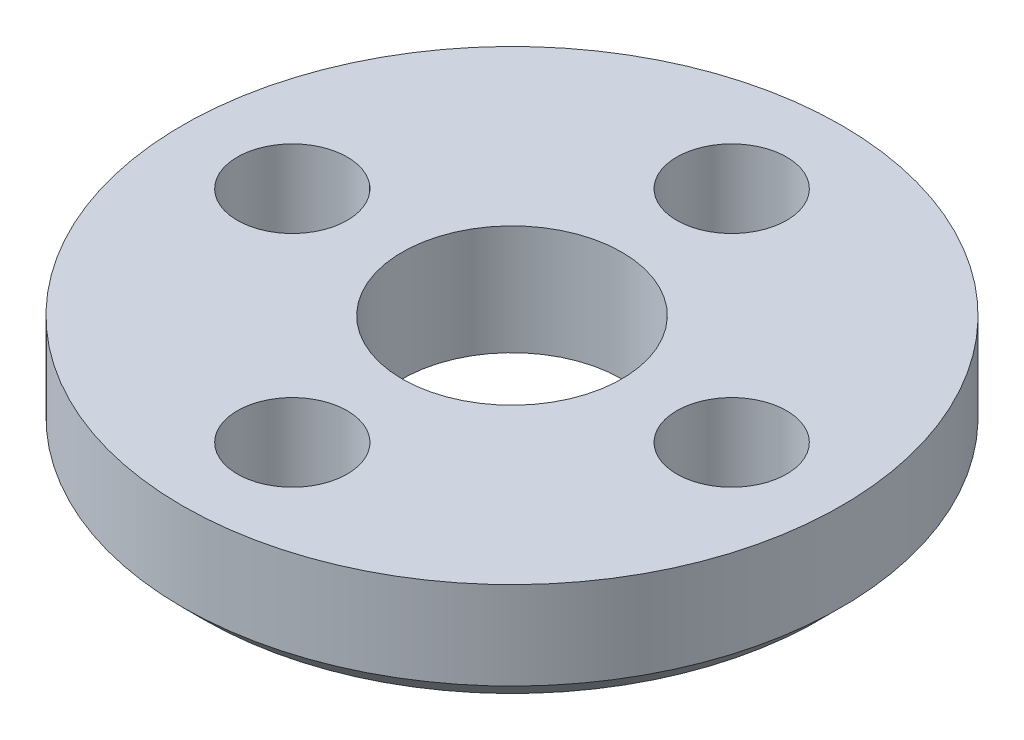
ISO-10303-21;
HEADER;
FILE_DESCRIPTION(('STEP AP214'),'2;1');
FILE_NAME('part.step','',(''),(''),'','','');
FILE_SCHEMA(('AUTOMOTIVE_DESIGN { 1 0 10303 214 1 1 1 1 }'));
ENDSEC;
DATA;
#1=APPLICATION_CONTEXT('core data for automotive mechanical design processes');
#2=APPLICATION_PROTOCOL_DEFINITION('international standard','automotive_design',2000,#1);
#3=PRODUCT_CONTEXT('',#1,'mechanical');
#4=PRODUCT('Part','Part','',(#3));
#5=PRODUCT_RELATED_PRODUCT_CATEGORY('part','',(#4));
#6=PRODUCT_DEFINITION_FORMATION('','',#4);
#7=PRODUCT_DEFINITION_CONTEXT('part definition',#1,'design');
#8=PRODUCT_DEFINITION('design','',#6,#7);
#9=PRODUCT_DEFINITION_SHAPE('','',#8);
#10=(LENGTH_UNIT() NAMED_UNIT(*) SI_UNIT(.MILLI.,.METRE.));
#11=(NAMED_UNIT(*) PLANE_ANGLE_UNIT() SI_UNIT($,.RADIAN.));
#12=(NAMED_UNIT(*) SI_UNIT($,.STERADIAN.) SOLID_ANGLE_UNIT());
#13=UNCERTAINTY_MEASURE_WITH_UNIT(LENGTH_MEASURE(1.E-05),#10,'distance_accuracy_value','');
#14=(GEOMETRIC_REPRESENTATION_CONTEXT(3) GLOBAL_UNCERTAINTY_ASSIGNED_CONTEXT((#13)) GLOBAL_UNIT_ASSIGNED_CONTEXT((#10,
#11,#12)) REPRESENTATION_CONTEXT('',''));
#15=CARTESIAN_POINT('',(0.,0.,0.));
#16=DIRECTION('',(0.,0.,1.));
#17=DIRECTION('',(1.,0.,0.));
#18=AXIS2_PLACEMENT_3D('',#15,#16,#17);
#19=CARTESIAN_POINT('',(0.,-5.,0.));
#20=DIRECTION('',(0.,1.,0.));
#21=DIRECTION('',(0.,0.,1.));
#22=AXIS2_PLACEMENT_3D('',#19,#20,#21);
#23=CYLINDRICAL_SURFACE('',#22,5.);
#24=CARTESIAN_POINT('',(0.,-5.,0.));
#25=DIRECTION('',(0.,1.,0.));
#26=DIRECTION('',(0.,0.,1.));
#27=AXIS2_PLACEMENT_3D('',#24,#25,#26);
#28=CIRCLE('',#27,5.);
#29=CARTESIAN_POINT('',(0.,-5.,5.));
#30=VERTEX_POINT('',#29);
#31=EDGE_CURVE('E61',#30,#30,#28,.T.);
#32=ORIENTED_EDGE('',*,*,#31,.F.);
#33=EDGE_LOOP('',(#32));
#34=FACE_BOUND('',#33,.T.);
#35=CARTESIAN_POINT('',(0.,0.,0.));
#36=DIRECTION('',(0.,1.,0.));
#37=DIRECTION('',(0.,0.,1.));
#38=AXIS2_PLACEMENT_3D('',#35,#36,#37);
#39=CIRCLE('',#38,5.);
#40=CARTESIAN_POINT('',(0.,0.,5.));
#41=VERTEX_POINT('',#40);
#42=EDGE_CURVE('E70',#41,#41,#39,.T.);
#43=ORIENTED_EDGE('',*,*,#42,.T.);
#44=EDGE_LOOP('',(#43));
#45=FACE_BOUND('',#44,.T.);
#46=ADVANCED_FACE('F49',(#34,#45),#23,.F.);
#47=CARTESIAN_POINT('',(0.,-5.,0.));
#48=DIRECTION('',(0.,1.,0.));
#49=DIRECTION('',(0.,0.,1.));
#50=AXIS2_PLACEMENT_3D('',#47,#48,#49);
#51=CYLINDRICAL_SURFACE('',#50,15.);
#52=CARTESIAN_POINT('',(0.,-3.99999999999999,0.));
#53=DIRECTION('',(0.,1.,0.));
#54=DIRECTION('',(0.,0.,1.));
#55=AXIS2_PLACEMENT_3D('',#52,#53,#54);
#56=CIRCLE('',#55,15.);
#57=CARTESIAN_POINT('',(0.,-3.99999999999999,15.));
#58=VERTEX_POINT('',#57);
#59=EDGE_CURVE('E57',#58,#58,#56,.T.);
#60=ORIENTED_EDGE('',*,*,#59,.T.);
#61=EDGE_LOOP('',(#60));
#62=FACE_BOUND('',#61,.T.);
#63=CARTESIAN_POINT('',(0.,0.,0.));
#64=DIRECTION('',(0.,1.,0.));
#65=DIRECTION('',(0.,0.,1.));
#66=AXIS2_PLACEMENT_3D('',#63,#64,#65);
#67=CIRCLE('',#66,15.);
#68=CARTESIAN_POINT('',(0.,0.,15.));
#69=VERTEX_POINT('',#68);
#70=EDGE_CURVE('E65',#69,#69,#67,.T.);
#71=ORIENTED_EDGE('',*,*,#70,.F.);
#72=EDGE_LOOP('',(#71));
#73=FACE_BOUND('',#72,.T.);
#74=ADVANCED_FACE('F123',(#62,#73),#51,.T.);
#75=CARTESIAN_POINT('',(0.,-5.,0.));
#76=DIRECTION('',(0.,1.,0.));
#77=DIRECTION('',(0.,0.,1.));
#78=AXIS2_PLACEMENT_3D('',#75,#76,#77);
#79=PLANE('',#78);
#80=CARTESIAN_POINT('',(0.,-5.,0.));
#81=DIRECTION('',(0.,1.,0.));
#82=DIRECTION('',(0.,0.,1.));
#83=AXIS2_PLACEMENT_3D('',#80,#81,#82);
#84=CIRCLE('',#83,14.);
#85=CARTESIAN_POINT('',(0.,-5.,14.));
#86=VERTEX_POINT('',#85);
#87=EDGE_CURVE('E11',#86,#86,#84,.F.);
#88=ORIENTED_EDGE('',*,*,#87,.T.);
#89=EDGE_LOOP('',(#88));
#90=FACE_BOUND('',#89,.T.);
#91=CARTESIAN_POINT('',(-10.,-5.,0.));
#92=DIRECTION('',(0.,1.,0.));
#93=DIRECTION('',(1.,0.,0.));
#94=AXIS2_PLACEMENT_3D('',#91,#92,#93);
#95=CIRCLE('',#94,2.5);
#96=CARTESIAN_POINT('',(-7.5,-5.,0.));
#97=VERTEX_POINT('',#96);
#98=EDGE_CURVE('E77',#97,#97,#95,.T.);
#99=ORIENTED_EDGE('',*,*,#98,.T.);
#100=EDGE_LOOP('',(#99));
#101=FACE_BOUND('',#100,.T.);
#102=CARTESIAN_POINT('',(0.,-5.,10.));
#103=DIRECTION('',(0.,1.,0.));
#104=DIRECTION('',(0.,0.,-1.));
#105=AXIS2_PLACEMENT_3D('',#102,#103,#104);
#106=CIRCLE('',#105,2.5);
#107=CARTESIAN_POINT('',(0.,-5.,7.5));
#108=VERTEX_POINT('',#107);
#109=EDGE_CURVE('E89',#108,#108,#106,.T.);
#110=ORIENTED_EDGE('',*,*,#109,.T.);
#111=EDGE_LOOP('',(#110));
#112=FACE_BOUND('',#111,.T.);
#113=CARTESIAN_POINT('',(10.,-5.,-1.0413211676572E-13));
#114=DIRECTION('',(0.,1.,0.));
#115=DIRECTION('',(-1.,0.,0.));
#116=AXIS2_PLACEMENT_3D('',#113,#114,#115);
#117=CIRCLE('',#116,2.5);
#118=CARTESIAN_POINT('',(7.5,-5.,0.));
#119=VERTEX_POINT('',#118);
#120=EDGE_CURVE('E83',#119,#119,#117,.T.);
#121=ORIENTED_EDGE('',*,*,#120,.T.);
#122=EDGE_LOOP('',(#121));
#123=FACE_BOUND('',#122,.T.);
#124=CARTESIAN_POINT('',(0.,-5.,-10.));
#125=DIRECTION('',(0.,1.,0.));
#126=DIRECTION('',(0.,0.,1.));
#127=AXIS2_PLACEMENT_3D('',#124,#125,#126);
#128=CIRCLE('',#127,2.5);
#129=CARTESIAN_POINT('',(0.,-5.,-7.5));
#130=VERTEX_POINT('',#129);
#131=EDGE_CURVE('E72',#130,#130,#128,.T.);
#132=ORIENTED_EDGE('',*,*,#131,.T.);
#133=EDGE_LOOP('',(#132));
#134=FACE_BOUND('',#133,.T.);
#135=ORIENTED_EDGE('',*,*,#31,.T.);
#136=EDGE_LOOP('',(#135));
#137=FACE_BOUND('',#136,.T.);
#138=ADVANCED_FACE('F98',(#90,#101,#112,#123,#134,#137),#79,.F.);
#139=CARTESIAN_POINT('',(0.,0.,0.));
#140=DIRECTION('',(0.,1.,0.));
#141=DIRECTION('',(0.,0.,1.));
#142=AXIS2_PLACEMENT_3D('',#139,#140,#141);
#143=PLANE('',#142);
#144=CARTESIAN_POINT('',(-10.,0.,0.));
#145=DIRECTION('',(0.,1.,0.));
#146=DIRECTION('',(1.,0.,0.));
#147=AXIS2_PLACEMENT_3D('',#144,#145,#146);
#148=CIRCLE('',#147,2.5);
#149=CARTESIAN_POINT('',(-7.5,0.,0.));
#150=VERTEX_POINT('',#149);
#151=EDGE_CURVE('E92',#150,#150,#148,.T.);
#152=ORIENTED_EDGE('',*,*,#151,.F.);
#153=EDGE_LOOP('',(#152));
#154=FACE_BOUND('',#153,.T.);
#155=CARTESIAN_POINT('',(0.,0.,10.));
#156=DIRECTION('',(0.,1.,0.));
#157=DIRECTION('',(0.,0.,-1.));
#158=AXIS2_PLACEMENT_3D('',#155,#156,#157);
#159=CIRCLE('',#158,2.5);
#160=CARTESIAN_POINT('',(0.,0.,7.5));
#161=VERTEX_POINT('',#160);
#162=EDGE_CURVE('E86',#161,#161,#159,.T.);
#163=ORIENTED_EDGE('',*,*,#162,.F.);
#164=EDGE_LOOP('',(#163));
#165=FACE_BOUND('',#164,.T.);
#166=CARTESIAN_POINT('',(10.,0.,-1.0413211676572E-13));
#167=DIRECTION('',(0.,1.,0.));
#168=DIRECTION('',(-1.,0.,0.));
#169=AXIS2_PLACEMENT_3D('',#166,#167,#168);
#170=CIRCLE('',#169,2.5);
#171=CARTESIAN_POINT('',(7.5,0.,0.));
#172=VERTEX_POINT('',#171);
#173=EDGE_CURVE('E80',#172,#172,#170,.T.);
#174=ORIENTED_EDGE('',*,*,#173,.F.);
#175=EDGE_LOOP('',(#174));
#176=FACE_BOUND('',#175,.T.);
#177=CARTESIAN_POINT('',(0.,0.,-10.));
#178=DIRECTION('',(0.,1.,0.));
#179=DIRECTION('',(0.,0.,1.));
#180=AXIS2_PLACEMENT_3D('',#177,#178,#179);
#181=CIRCLE('',#180,2.5);
#182=CARTESIAN_POINT('',(0.,0.,-7.5));
#183=VERTEX_POINT('',#182);
#184=EDGE_CURVE('E74',#183,#183,#181,.T.);
#185=ORIENTED_EDGE('',*,*,#184,.F.);
#186=EDGE_LOOP('',(#185));
#187=FACE_BOUND('',#186,.T.);
#188=ORIENTED_EDGE('',*,*,#42,.F.);
#189=EDGE_LOOP('',(#188));
#190=FACE_BOUND('',#189,.T.);
#191=ORIENTED_EDGE('',*,*,#70,.T.);
#192=EDGE_LOOP('',(#191));
#193=FACE_BOUND('',#192,.T.);
#194=ADVANCED_FACE('F108',(#154,#165,#176,#187,#190,#193),#143,.T.);
#195=CARTESIAN_POINT('',(0.,-5.,-10.));
#196=DIRECTION('',(0.,1.,0.));
#197=DIRECTION('',(0.,0.,1.));
#198=AXIS2_PLACEMENT_3D('',#195,#196,#197);
#199=CYLINDRICAL_SURFACE('',#198,2.5);
#200=ORIENTED_EDGE('',*,*,#131,.F.);
#201=EDGE_LOOP('',(#200));
#202=FACE_BOUND('',#201,.T.);
#203=ORIENTED_EDGE('',*,*,#184,.T.);
#204=EDGE_LOOP('',(#203));
#205=FACE_BOUND('',#204,.T.);
#206=ADVANCED_FACE('F111',(#202,#205),#199,.F.);
#207=CARTESIAN_POINT('',(10.,-5.,-1.0413211676572E-13));
#208=DIRECTION('',(0.,1.,0.));
#209=DIRECTION('',(0.,0.,1.));
#210=AXIS2_PLACEMENT_3D('',#207,#208,#209);
#211=CYLINDRICAL_SURFACE('',#210,2.5);
#212=ORIENTED_EDGE('',*,*,#120,.F.);
#213=EDGE_LOOP('',(#212));
#214=FACE_BOUND('',#213,.T.);
#215=ORIENTED_EDGE('',*,*,#173,.T.);
#216=EDGE_LOOP('',(#215));
#217=FACE_BOUND('',#216,.T.);
#218=ADVANCED_FACE('F135',(#214,#217),#211,.F.);
#219=CARTESIAN_POINT('',(0.,-5.,10.));
#220=DIRECTION('',(0.,1.,0.));
#221=DIRECTION('',(0.,0.,1.));
#222=AXIS2_PLACEMENT_3D('',#219,#220,#221);
#223=CYLINDRICAL_SURFACE('',#222,2.5);
#224=ORIENTED_EDGE('',*,*,#109,.F.);
#225=EDGE_LOOP('',(#224));
#226=FACE_BOUND('',#225,.T.);
#227=ORIENTED_EDGE('',*,*,#162,.T.);
#228=EDGE_LOOP('',(#227));
#229=FACE_BOUND('',#228,.T.);
#230=ADVANCED_FACE('F104',(#226,#229),#223,.F.);
#231=CARTESIAN_POINT('',(-10.,-5.,0.));
#232=DIRECTION('',(0.,1.,0.));
#233=DIRECTION('',(0.,0.,1.));
#234=AXIS2_PLACEMENT_3D('',#231,#232,#233);
#235=CYLINDRICAL_SURFACE('',#234,2.5);
#236=ORIENTED_EDGE('',*,*,#98,.F.);
#237=EDGE_LOOP('',(#236));
#238=FACE_BOUND('',#237,.T.);
#239=ORIENTED_EDGE('',*,*,#151,.T.);
#240=EDGE_LOOP('',(#239));
#241=FACE_BOUND('',#240,.T.);
#242=ADVANCED_FACE('F101',(#238,#241),#235,.F.);
#243=CARTESIAN_POINT('',(0.,-3.99999999999999,0.));
#244=DIRECTION('',(0.,1.,0.));
#245=DIRECTION('',(0.,0.,1.));
#246=AXIS2_PLACEMENT_3D('',#243,#244,#245);
#247=CONICAL_SURFACE('',#246,15.,0.785398163397447);
#248=ORIENTED_EDGE('',*,*,#87,.F.);
#249=EDGE_LOOP('',(#248));
#250=FACE_BOUND('',#249,.T.);
#251=ORIENTED_EDGE('',*,*,#59,.F.);
#252=EDGE_LOOP('',(#251));
#253=FACE_BOUND('',#252,.T.);
#254=ADVANCED_FACE('F52',(#250,#253),#247,.T.);
#255=CLOSED_SHELL('',(#46,#74,#138,#194,#206,#218,#230,#242,#254));
#256=MANIFOLD_SOLID_BREP('B2',#255);
#257=ADVANCED_BREP_SHAPE_REPRESENTATION('',(#18,#256),#14);
#258=SHAPE_DEFINITION_REPRESENTATION(#9,#257);
ENDSEC;
END-ISO-10303-21;
